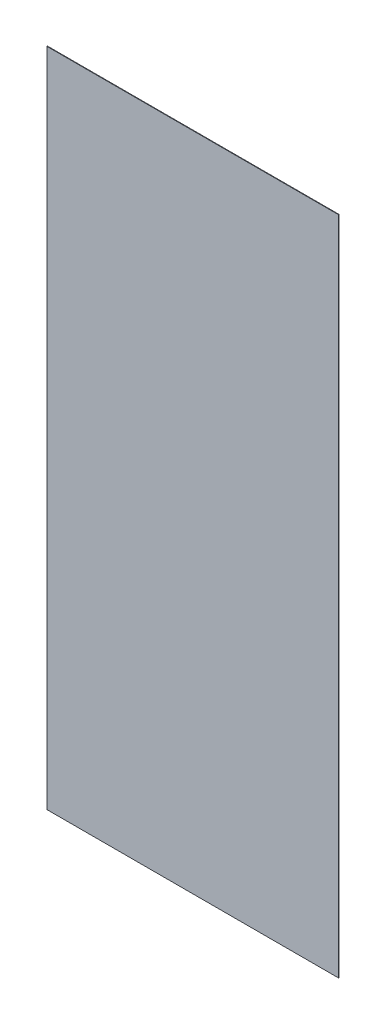
ISO-10303-21;
HEADER;
FILE_DESCRIPTION(('STEP AP214'),'2;1');
FILE_NAME('part.step','',(''),(''),'','','');
FILE_SCHEMA(('AUTOMOTIVE_DESIGN { 1 0 10303 214 1 1 1 1 }'));
ENDSEC;
DATA;
#1=APPLICATION_CONTEXT('core data for automotive mechanical design processes');
#2=APPLICATION_PROTOCOL_DEFINITION('international standard','automotive_design',2000,#1);
#3=PRODUCT_CONTEXT('',#1,'mechanical');
#4=PRODUCT('Part','Part','',(#3));
#5=PRODUCT_RELATED_PRODUCT_CATEGORY('part','',(#4));
#6=PRODUCT_DEFINITION_FORMATION('','',#4);
#7=PRODUCT_DEFINITION_CONTEXT('part definition',#1,'design');
#8=PRODUCT_DEFINITION('design','',#6,#7);
#9=PRODUCT_DEFINITION_SHAPE('','',#8);
#10=(LENGTH_UNIT() NAMED_UNIT(*) SI_UNIT(.MILLI.,.METRE.));
#11=(NAMED_UNIT(*) PLANE_ANGLE_UNIT() SI_UNIT($,.RADIAN.));
#12=(NAMED_UNIT(*) SI_UNIT($,.STERADIAN.) SOLID_ANGLE_UNIT());
#13=UNCERTAINTY_MEASURE_WITH_UNIT(LENGTH_MEASURE(1.E-05),#10,'distance_accuracy_value','');
#14=(GEOMETRIC_REPRESENTATION_CONTEXT(3) GLOBAL_UNCERTAINTY_ASSIGNED_CONTEXT((#13)) GLOBAL_UNIT_ASSIGNED_CONTEXT((#10,
#11,#12)) REPRESENTATION_CONTEXT('',''));
#15=CARTESIAN_POINT('',(0.,0.,0.));
#16=DIRECTION('',(0.,0.,1.));
#17=DIRECTION('',(1.,0.,0.));
#18=AXIS2_PLACEMENT_3D('',#15,#16,#17);
#19=CARTESIAN_POINT('',(0.,0.,-1.));
#20=DIRECTION('',(-1.,0.,0.));
#21=DIRECTION('',(0.,-1.,0.));
#22=AXIS2_PLACEMENT_3D('',#19,#20,#21);
#23=PLANE('',#22);
#24=DIRECTION('',(0.,-1.,0.));
#25=VECTOR('',#24,1.);
#26=CARTESIAN_POINT('',(0.,0.,0.));
#27=LINE('',#26,#25);
#28=CARTESIAN_POINT('',(-2.22044604925031E-13,1243.,0.));
#29=VERTEX_POINT('',#28);
#30=CARTESIAN_POINT('',(0.,0.,0.));
#31=VERTEX_POINT('',#30);
#32=EDGE_CURVE('E102',#29,#31,#27,.T.);
#33=ORIENTED_EDGE('',*,*,#32,.F.);
#34=DIRECTION('',(0.,0.,1.));
#35=VECTOR('',#34,1.);
#36=CARTESIAN_POINT('',(-2.22044604925031E-13,1243.,-1.));
#37=LINE('',#36,#35);
#38=CARTESIAN_POINT('',(-2.22044604925031E-13,1243.,-1.));
#39=VERTEX_POINT('',#38);
#40=EDGE_CURVE('E11',#39,#29,#37,.T.);
#41=ORIENTED_EDGE('',*,*,#40,.F.);
#42=DIRECTION('',(0.,-1.,0.));
#43=VECTOR('',#42,1.);
#44=CARTESIAN_POINT('',(0.,0.,-1.));
#45=LINE('',#44,#43);
#46=CARTESIAN_POINT('',(0.,0.,-1.));
#47=VERTEX_POINT('',#46);
#48=EDGE_CURVE('E96',#39,#47,#45,.T.);
#49=ORIENTED_EDGE('',*,*,#48,.T.);
#50=DIRECTION('',(0.,0.,1.));
#51=VECTOR('',#50,1.);
#52=CARTESIAN_POINT('',(0.,0.,-1.));
#53=LINE('',#52,#51);
#54=EDGE_CURVE('E41',#47,#31,#53,.T.);
#55=ORIENTED_EDGE('',*,*,#54,.T.);
#56=EDGE_LOOP('',(#33,#41,#49,#55));
#57=FACE_BOUND('',#56,.T.);
#58=ADVANCED_FACE('F38',(#57),#23,.T.);
#59=CARTESIAN_POINT('',(-2.22044604925031E-13,1243.,-1.));
#60=DIRECTION('',(0.,1.,0.));
#61=DIRECTION('',(0.,0.,1.));
#62=AXIS2_PLACEMENT_3D('',#59,#60,#61);
#63=PLANE('',#62);
#64=DIRECTION('',(-1.,0.,0.));
#65=VECTOR('',#64,1.);
#66=CARTESIAN_POINT('',(-2.22044604925031E-13,1243.,0.));
#67=LINE('',#66,#65);
#68=CARTESIAN_POINT('',(548.58,1243.,0.));
#69=VERTEX_POINT('',#68);
#70=EDGE_CURVE('E98',#69,#29,#67,.T.);
#71=ORIENTED_EDGE('',*,*,#70,.F.);
#72=DIRECTION('',(0.,0.,1.));
#73=VECTOR('',#72,1.);
#74=CARTESIAN_POINT('',(548.58,1243.,-1.));
#75=LINE('',#74,#73);
#76=CARTESIAN_POINT('',(548.58,1243.,-1.));
#77=VERTEX_POINT('',#76);
#78=EDGE_CURVE('E47',#77,#69,#75,.T.);
#79=ORIENTED_EDGE('',*,*,#78,.F.);
#80=DIRECTION('',(-1.,0.,0.));
#81=VECTOR('',#80,1.);
#82=CARTESIAN_POINT('',(-2.22044604925031E-13,1243.,-1.));
#83=LINE('',#82,#81);
#84=EDGE_CURVE('E93',#77,#39,#83,.T.);
#85=ORIENTED_EDGE('',*,*,#84,.T.);
#86=ORIENTED_EDGE('',*,*,#40,.T.);
#87=EDGE_LOOP('',(#71,#79,#85,#86));
#88=FACE_BOUND('',#87,.T.);
#89=ADVANCED_FACE('F112',(#88),#63,.T.);
#90=CARTESIAN_POINT('',(548.58,0.,-1.));
#91=DIRECTION('',(1.,0.,0.));
#92=DIRECTION('',(0.,1.,0.));
#93=AXIS2_PLACEMENT_3D('',#90,#91,#92);
#94=PLANE('',#93);
#95=DIRECTION('',(0.,1.,0.));
#96=VECTOR('',#95,1.);
#97=CARTESIAN_POINT('',(548.58,0.,0.));
#98=LINE('',#97,#96);
#99=CARTESIAN_POINT('',(548.58,0.,0.));
#100=VERTEX_POINT('',#99);
#101=EDGE_CURVE('E88',#100,#69,#98,.T.);
#102=ORIENTED_EDGE('',*,*,#101,.F.);
#103=DIRECTION('',(0.,0.,1.));
#104=VECTOR('',#103,1.);
#105=CARTESIAN_POINT('',(548.58,0.,-1.));
#106=LINE('',#105,#104);
#107=CARTESIAN_POINT('',(548.58,0.,-1.));
#108=VERTEX_POINT('',#107);
#109=EDGE_CURVE('E83',#108,#100,#106,.T.);
#110=ORIENTED_EDGE('',*,*,#109,.F.);
#111=DIRECTION('',(0.,1.,0.));
#112=VECTOR('',#111,1.);
#113=CARTESIAN_POINT('',(548.58,0.,-1.));
#114=LINE('',#113,#112);
#115=EDGE_CURVE('E86',#108,#77,#114,.T.);
#116=ORIENTED_EDGE('',*,*,#115,.T.);
#117=ORIENTED_EDGE('',*,*,#78,.T.);
#118=EDGE_LOOP('',(#102,#110,#116,#117));
#119=FACE_BOUND('',#118,.T.);
#120=ADVANCED_FACE('F85',(#119),#94,.T.);
#121=CARTESIAN_POINT('',(0.,0.,-1.));
#122=DIRECTION('',(0.,-1.,0.));
#123=DIRECTION('',(0.,0.,-1.));
#124=AXIS2_PLACEMENT_3D('',#121,#122,#123);
#125=PLANE('',#124);
#126=DIRECTION('',(1.,0.,0.));
#127=VECTOR('',#126,1.);
#128=CARTESIAN_POINT('',(0.,0.,0.));
#129=LINE('',#128,#127);
#130=EDGE_CURVE('E105',#31,#100,#129,.T.);
#131=ORIENTED_EDGE('',*,*,#130,.F.);
#132=ORIENTED_EDGE('',*,*,#54,.F.);
#133=DIRECTION('',(1.,0.,0.));
#134=VECTOR('',#133,1.);
#135=CARTESIAN_POINT('',(0.,0.,-1.));
#136=LINE('',#135,#134);
#137=EDGE_CURVE('E92',#47,#108,#136,.T.);
#138=ORIENTED_EDGE('',*,*,#137,.T.);
#139=ORIENTED_EDGE('',*,*,#109,.T.);
#140=EDGE_LOOP('',(#131,#132,#138,#139));
#141=FACE_BOUND('',#140,.T.);
#142=ADVANCED_FACE('F95',(#141),#125,.T.);
#143=CARTESIAN_POINT('',(0.,0.,-1.));
#144=DIRECTION('',(0.,0.,-1.));
#145=DIRECTION('',(-1.,0.,0.));
#146=AXIS2_PLACEMENT_3D('',#143,#144,#145);
#147=PLANE('',#146);
#148=ORIENTED_EDGE('',*,*,#48,.F.);
#149=ORIENTED_EDGE('',*,*,#84,.F.);
#150=ORIENTED_EDGE('',*,*,#115,.F.);
#151=ORIENTED_EDGE('',*,*,#137,.F.);
#152=EDGE_LOOP('',(#148,#149,#150,#151));
#153=FACE_BOUND('',#152,.T.);
#154=ADVANCED_FACE('F91',(#153),#147,.T.);
#155=CARTESIAN_POINT('',(0.,0.,0.));
#156=DIRECTION('',(0.,0.,-1.));
#157=DIRECTION('',(-1.,0.,0.));
#158=AXIS2_PLACEMENT_3D('',#155,#156,#157);
#159=PLANE('',#158);
#160=ORIENTED_EDGE('',*,*,#32,.T.);
#161=ORIENTED_EDGE('',*,*,#130,.T.);
#162=ORIENTED_EDGE('',*,*,#101,.T.);
#163=ORIENTED_EDGE('',*,*,#70,.T.);
#164=EDGE_LOOP('',(#160,#161,#162,#163));
#165=FACE_BOUND('',#164,.T.);
#166=ADVANCED_FACE('F111',(#165),#159,.F.);
#167=CLOSED_SHELL('',(#58,#89,#120,#142,#154,#166));
#168=MANIFOLD_SOLID_BREP('B2',#167);
#169=ADVANCED_BREP_SHAPE_REPRESENTATION('',(#18,#168),#14);
#170=SHAPE_DEFINITION_REPRESENTATION(#9,#169);
ENDSEC;
END-ISO-10303-21;
